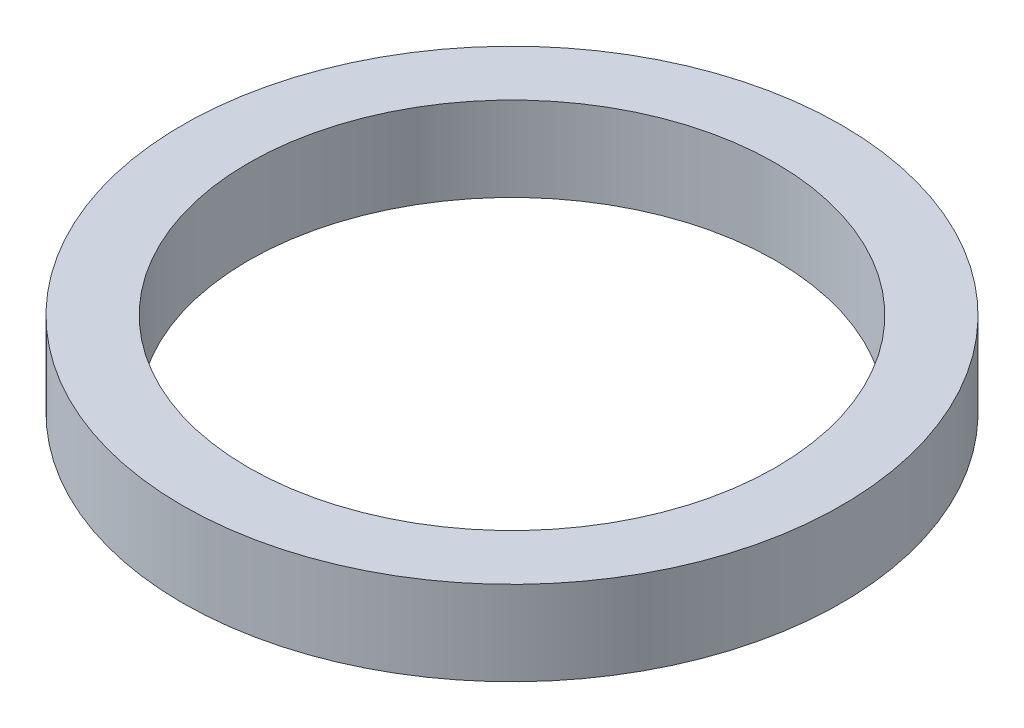
ISO-10303-21;
HEADER;
FILE_DESCRIPTION(('STEP AP214'),'2;1');
FILE_NAME('part.step','',(''),(''),'','','');
FILE_SCHEMA(('AUTOMOTIVE_DESIGN { 1 0 10303 214 1 1 1 1 }'));
ENDSEC;
DATA;
#1=APPLICATION_CONTEXT('core data for automotive mechanical design processes');
#2=APPLICATION_PROTOCOL_DEFINITION('international standard','automotive_design',2000,#1);
#3=PRODUCT_CONTEXT('',#1,'mechanical');
#4=PRODUCT('Part','Part','',(#3));
#5=PRODUCT_RELATED_PRODUCT_CATEGORY('part','',(#4));
#6=PRODUCT_DEFINITION_FORMATION('','',#4);
#7=PRODUCT_DEFINITION_CONTEXT('part definition',#1,'design');
#8=PRODUCT_DEFINITION('design','',#6,#7);
#9=PRODUCT_DEFINITION_SHAPE('','',#8);
#10=(LENGTH_UNIT() NAMED_UNIT(*) SI_UNIT(.MILLI.,.METRE.));
#11=(NAMED_UNIT(*) PLANE_ANGLE_UNIT() SI_UNIT($,.RADIAN.));
#12=(NAMED_UNIT(*) SI_UNIT($,.STERADIAN.) SOLID_ANGLE_UNIT());
#13=UNCERTAINTY_MEASURE_WITH_UNIT(LENGTH_MEASURE(1.E-05),#10,'distance_accuracy_value','');
#14=(GEOMETRIC_REPRESENTATION_CONTEXT(3) GLOBAL_UNCERTAINTY_ASSIGNED_CONTEXT((#13)) GLOBAL_UNIT_ASSIGNED_CONTEXT((#10,
#11,#12)) REPRESENTATION_CONTEXT('',''));
#15=CARTESIAN_POINT('',(0.,0.,0.));
#16=DIRECTION('',(0.,0.,1.));
#17=DIRECTION('',(1.,0.,0.));
#18=AXIS2_PLACEMENT_3D('',#15,#16,#17);
#19=CARTESIAN_POINT('',(0.,16.,0.));
#20=DIRECTION('',(0.,-1.,0.));
#21=DIRECTION('',(0.,0.,-1.));
#22=AXIS2_PLACEMENT_3D('',#19,#20,#21);
#23=CYLINDRICAL_SURFACE('',#22,62.5);
#24=CARTESIAN_POINT('',(0.,16.,0.));
#25=DIRECTION('',(0.,1.,0.));
#26=DIRECTION('',(0.,0.,1.));
#27=AXIS2_PLACEMENT_3D('',#24,#25,#26);
#28=CIRCLE('',#27,62.5);
#29=CARTESIAN_POINT('',(0.,16.,62.5));
#30=VERTEX_POINT('',#29);
#31=EDGE_CURVE('E10',#30,#30,#28,.T.);
#32=ORIENTED_EDGE('',*,*,#31,.F.);
#33=EDGE_LOOP('',(#32));
#34=FACE_BOUND('',#33,.T.);
#35=CARTESIAN_POINT('',(0.,0.,0.));
#36=DIRECTION('',(0.,1.,0.));
#37=DIRECTION('',(0.,0.,1.));
#38=AXIS2_PLACEMENT_3D('',#35,#36,#37);
#39=CIRCLE('',#38,62.5);
#40=CARTESIAN_POINT('',(0.,0.,62.5));
#41=VERTEX_POINT('',#40);
#42=EDGE_CURVE('E37',#41,#41,#39,.T.);
#43=ORIENTED_EDGE('',*,*,#42,.T.);
#44=EDGE_LOOP('',(#43));
#45=FACE_BOUND('',#44,.T.);
#46=ADVANCED_FACE('F40',(#34,#45),#23,.T.);
#47=CARTESIAN_POINT('',(0.,16.,0.));
#48=DIRECTION('',(0.,1.,0.));
#49=DIRECTION('',(0.,0.,1.));
#50=AXIS2_PLACEMENT_3D('',#47,#48,#49);
#51=PLANE('',#50);
#52=CARTESIAN_POINT('',(0.,16.,0.));
#53=DIRECTION('',(0.,1.,0.));
#54=DIRECTION('',(0.,0.,1.));
#55=AXIS2_PLACEMENT_3D('',#52,#53,#54);
#56=CIRCLE('',#55,50.);
#57=CARTESIAN_POINT('',(0.,16.,50.));
#58=VERTEX_POINT('',#57);
#59=EDGE_CURVE('E50',#58,#58,#56,.T.);
#60=ORIENTED_EDGE('',*,*,#59,.F.);
#61=EDGE_LOOP('',(#60));
#62=FACE_BOUND('',#61,.T.);
#63=ORIENTED_EDGE('',*,*,#31,.T.);
#64=EDGE_LOOP('',(#63));
#65=FACE_BOUND('',#64,.T.);
#66=ADVANCED_FACE('F59',(#62,#65),#51,.T.);
#67=CARTESIAN_POINT('',(0.,0.,0.));
#68=DIRECTION('',(0.,1.,0.));
#69=DIRECTION('',(0.,0.,1.));
#70=AXIS2_PLACEMENT_3D('',#67,#68,#69);
#71=PLANE('',#70);
#72=CARTESIAN_POINT('',(0.,0.,0.));
#73=DIRECTION('',(0.,1.,0.));
#74=DIRECTION('',(0.,0.,1.));
#75=AXIS2_PLACEMENT_3D('',#72,#73,#74);
#76=CIRCLE('',#75,50.);
#77=CARTESIAN_POINT('',(0.,0.,50.));
#78=VERTEX_POINT('',#77);
#79=EDGE_CURVE('E47',#78,#78,#76,.T.);
#80=ORIENTED_EDGE('',*,*,#79,.T.);
#81=EDGE_LOOP('',(#80));
#82=FACE_BOUND('',#81,.T.);
#83=ORIENTED_EDGE('',*,*,#42,.F.);
#84=EDGE_LOOP('',(#83));
#85=FACE_BOUND('',#84,.T.);
#86=ADVANCED_FACE('F58',(#82,#85),#71,.F.);
#87=CARTESIAN_POINT('',(0.,16.,0.));
#88=DIRECTION('',(0.,-1.,0.));
#89=DIRECTION('',(0.,0.,-1.));
#90=AXIS2_PLACEMENT_3D('',#87,#88,#89);
#91=CYLINDRICAL_SURFACE('',#90,50.);
#92=ORIENTED_EDGE('',*,*,#59,.T.);
#93=EDGE_LOOP('',(#92));
#94=FACE_BOUND('',#93,.T.);
#95=ORIENTED_EDGE('',*,*,#79,.F.);
#96=EDGE_LOOP('',(#95));
#97=FACE_BOUND('',#96,.T.);
#98=ADVANCED_FACE('F54',(#94,#97),#91,.F.);
#99=CLOSED_SHELL('',(#46,#66,#86,#98));
#100=MANIFOLD_SOLID_BREP('B2',#99);
#101=ADVANCED_BREP_SHAPE_REPRESENTATION('',(#18,#100),#14);
#102=SHAPE_DEFINITION_REPRESENTATION(#9,#101);
ENDSEC;
END-ISO-10303-21;
